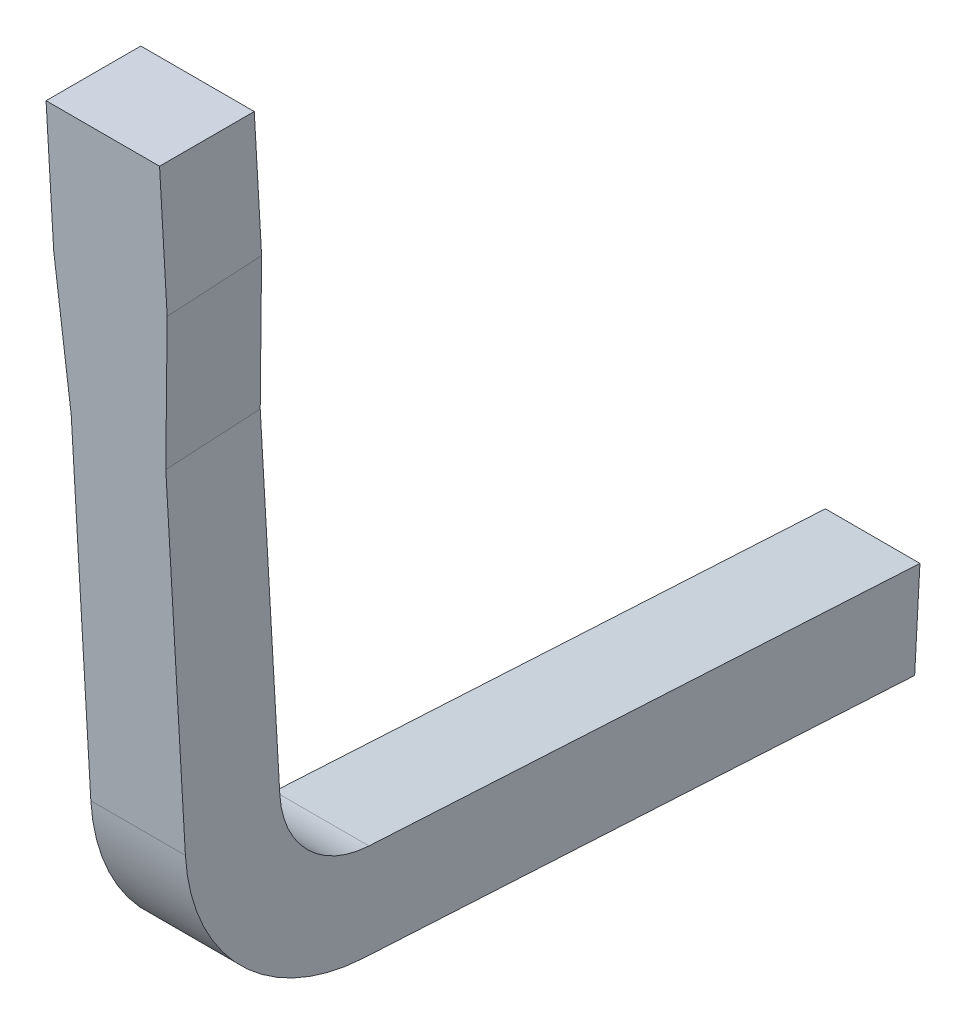
ISO-10303-21;
HEADER;
FILE_DESCRIPTION(('STEP AP214'),'2;1');
FILE_NAME('part.step','',(''),(''),'','','');
FILE_SCHEMA(('AUTOMOTIVE_DESIGN { 1 0 10303 214 1 1 1 1 }'));
ENDSEC;
DATA;
#1=APPLICATION_CONTEXT('core data for automotive mechanical design processes');
#2=APPLICATION_PROTOCOL_DEFINITION('international standard','automotive_design',2000,#1);
#3=PRODUCT_CONTEXT('',#1,'mechanical');
#4=PRODUCT('Part','Part','',(#3));
#5=PRODUCT_RELATED_PRODUCT_CATEGORY('part','',(#4));
#6=PRODUCT_DEFINITION_FORMATION('','',#4);
#7=PRODUCT_DEFINITION_CONTEXT('part definition',#1,'design');
#8=PRODUCT_DEFINITION('design','',#6,#7);
#9=PRODUCT_DEFINITION_SHAPE('','',#8);
#10=(LENGTH_UNIT() NAMED_UNIT(*) SI_UNIT(.MILLI.,.METRE.));
#11=(NAMED_UNIT(*) PLANE_ANGLE_UNIT() SI_UNIT($,.RADIAN.));
#12=(NAMED_UNIT(*) SI_UNIT($,.STERADIAN.) SOLID_ANGLE_UNIT());
#13=UNCERTAINTY_MEASURE_WITH_UNIT(LENGTH_MEASURE(1.E-05),#10,'distance_accuracy_value','');
#14=(GEOMETRIC_REPRESENTATION_CONTEXT(3) GLOBAL_UNCERTAINTY_ASSIGNED_CONTEXT((#13)) GLOBAL_UNIT_ASSIGNED_CONTEXT((#10,
#11,#12)) REPRESENTATION_CONTEXT('',''));
#15=CARTESIAN_POINT('',(0.,0.,0.));
#16=DIRECTION('',(0.,0.,1.));
#17=DIRECTION('',(1.,0.,0.));
#18=AXIS2_PLACEMENT_3D('',#15,#16,#17);
#19=CARTESIAN_POINT('',(-2.12,-1.879082198882,-10.32387202233));
#20=DIRECTION('',(1.,0.,0.));
#21=DIRECTION('',(0.,0.,-1.));
#22=AXIS2_PLACEMENT_3D('',#19,#20,#21);
#23=PLANE('',#22);
#24=DIRECTION('',(1.77809156290928E-13,-0.0569406083160486,0.998377567418559));
#25=VECTOR('',#24,1.);
#26=CARTESIAN_POINT('',(-2.12,-2.014836222708,-10.43177700759));
#27=LINE('',#26,#25);
#28=CARTESIAN_POINT('',(-2.12,-2.01483622270796,-10.4317770075908));
#29=VERTEX_POINT('',#28);
#30=CARTESIAN_POINT('',(-2.11999999999999,-2.02622434437119,-10.2321014941066));
#31=VERTEX_POINT('',#30);
#32=EDGE_CURVE('E183',#29,#31,#27,.T.);
#33=ORIENTED_EDGE('',*,*,#32,.T.);
#34=DIRECTION('',(0.,-0.998377567418999,-0.0569406083083299));
#35=VECTOR('',#34,1.);
#36=CARTESIAN_POINT('',(-2.12,-2.398052209196,-10.25330800505));
#37=LINE('',#36,#35);
#38=CARTESIAN_POINT('',(-2.12,-1.74332817505504,-10.2159670370689));
#39=VERTEX_POINT('',#38);
#40=EDGE_CURVE('E180',#39,#31,#37,.T.);
#41=ORIENTED_EDGE('',*,*,#40,.F.);
#42=DIRECTION('',(0.,0.,1.));
#43=VECTOR('',#42,1.);
#44=CARTESIAN_POINT('',(-2.12,-1.743328175055,-10.31612954398));
#45=LINE('',#44,#43);
#46=CARTESIAN_POINT('',(-2.12,-1.74332817505473,-10.4162920508947));
#47=VERTEX_POINT('',#46);
#48=EDGE_CURVE('E175',#47,#39,#45,.T.);
#49=ORIENTED_EDGE('',*,*,#48,.F.);
#50=DIRECTION('',(0.,-0.998377567418624,-0.0569406083148914));
#51=VECTOR('',#50,1.);
#52=CARTESIAN_POINT('',(-2.12,-2.392358148368,-10.45330826871));
#53=LINE('',#52,#51);
#54=EDGE_CURVE('E205',#47,#29,#53,.T.);
#55=ORIENTED_EDGE('',*,*,#54,.T.);
#56=EDGE_LOOP('',(#33,#41,#49,#55));
#57=FACE_BOUND('',#56,.T.);
#58=ADVANCED_FACE('F17',(#57),#23,.F.);
#59=CARTESIAN_POINT('',(-2.11,-2.170286918652,-10.3404803421));
#60=DIRECTION('',(0.997785157856611,0.0664110879137907,0.00378763292362404));
#61=DIRECTION('',(-0.0664115642910679,0.99779231512796,0.));
#62=AXIS2_PLACEMENT_3D('',#59,#60,#61);
#63=PLANE('',#62);
#64=DIRECTION('',(0.0665190105237393,-0.996166318707665,-0.0568144938493813));
#65=VECTOR('',#64,1.);
#66=CARTESIAN_POINT('',(-2.12,-2.02622434437119,-10.2321014941066));
#67=LINE('',#66,#65);
#68=CARTESIAN_POINT('',(-2.1,-2.32573761459706,-10.2491836765991));
#69=VERTEX_POINT('',#68);
#70=EDGE_CURVE('E161',#31,#69,#67,.T.);
#71=ORIENTED_EDGE('',*,*,#70,.F.);
#72=ORIENTED_EDGE('',*,*,#32,.F.);
#73=DIRECTION('',(0.0665190105237394,-0.996166318707292,-0.0568144938559241));
#74=VECTOR('',#73,1.);
#75=CARTESIAN_POINT('',(-2.12,-2.01483622270793,-10.4317770075911));
#76=LINE('',#75,#74);
#77=CARTESIAN_POINT('',(-2.1,-2.31434949293379,-10.4488591900838));
#78=VERTEX_POINT('',#77);
#79=EDGE_CURVE('E115',#29,#78,#76,.T.);
#80=ORIENTED_EDGE('',*,*,#79,.T.);
#81=DIRECTION('',(0.,-0.0569406083160594,0.998377567418558));
#82=VECTOR('',#81,1.);
#83=CARTESIAN_POINT('',(-2.1,-2.314349492934,-10.44885919008));
#84=LINE('',#83,#82);
#85=EDGE_CURVE('E110',#78,#69,#84,.T.);
#86=ORIENTED_EDGE('',*,*,#85,.T.);
#87=EDGE_LOOP('',(#71,#72,#80,#86));
#88=FACE_BOUND('',#87,.T.);
#89=ADVANCED_FACE('F288',(#88),#63,.F.);
#90=CARTESIAN_POINT('',(-1.88,-1.879082198882,-10.32387202233));
#91=DIRECTION('',(1.,0.,0.));
#92=DIRECTION('',(0.,0.,-1.));
#93=AXIS2_PLACEMENT_3D('',#90,#91,#92);
#94=PLANE('',#93);
#95=DIRECTION('',(0.,-0.998377567418624,-0.0569406083148914));
#96=VECTOR('',#95,1.);
#97=CARTESIAN_POINT('',(-1.88,-2.392358148368,-10.45330826871));
#98=LINE('',#97,#96);
#99=CARTESIAN_POINT('',(-1.87999999999998,-2.01483622270898,-10.4317770075904));
#100=VERTEX_POINT('',#99);
#101=CARTESIAN_POINT('',(-1.88,-1.74332817505473,-10.4162920508947));
#102=VERTEX_POINT('',#101);
#103=EDGE_CURVE('E128',#100,#102,#98,.F.);
#104=ORIENTED_EDGE('',*,*,#103,.T.);
#105=DIRECTION('',(0.,0.,1.));
#106=VECTOR('',#105,1.);
#107=CARTESIAN_POINT('',(-1.88,-1.743328175055,-10.31612954398));
#108=LINE('',#107,#106);
#109=CARTESIAN_POINT('',(-1.88,-1.74332817505504,-10.2159670370692));
#110=VERTEX_POINT('',#109);
#111=EDGE_CURVE('E185',#110,#102,#108,.F.);
#112=ORIENTED_EDGE('',*,*,#111,.F.);
#113=DIRECTION('',(0.,-0.998377567418999,-0.0569406083083299));
#114=VECTOR('',#113,1.);
#115=CARTESIAN_POINT('',(-1.88,-2.398052209196,-10.25330800505));
#116=LINE('',#115,#114);
#117=CARTESIAN_POINT('',(-1.87999999999999,-2.02622434437119,-10.2321014941066));
#118=VERTEX_POINT('',#117);
#119=EDGE_CURVE('E168',#118,#110,#116,.F.);
#120=ORIENTED_EDGE('',*,*,#119,.F.);
#121=DIRECTION('',(0.,-0.0569406083110731,0.998377567418842));
#122=VECTOR('',#121,1.);
#123=CARTESIAN_POINT('',(-1.87999999999997,-2.014836222709,-10.43177700759));
#124=LINE('',#123,#122);
#125=EDGE_CURVE('E131',#100,#118,#124,.T.);
#126=ORIENTED_EDGE('',*,*,#125,.F.);
#127=EDGE_LOOP('',(#104,#112,#120,#126));
#128=FACE_BOUND('',#127,.T.);
#129=ADVANCED_FACE('F251',(#128),#94,.T.);
#130=CARTESIAN_POINT('',(-2.,-1.743328175055,-10.31612954398));
#131=DIRECTION('',(0.,1.,0.));
#132=DIRECTION('',(0.,0.,1.));
#133=AXIS2_PLACEMENT_3D('',#130,#131,#132);
#134=PLANE('',#133);
#135=DIRECTION('',(1.,0.,0.));
#136=VECTOR('',#135,1.);
#137=CARTESIAN_POINT('',(-2.,-1.74332817505459,-10.4162920508971));
#138=LINE('',#137,#136);
#139=EDGE_CURVE('E138',#102,#47,#138,.F.);
#140=ORIENTED_EDGE('',*,*,#139,.T.);
#141=ORIENTED_EDGE('',*,*,#48,.T.);
#142=DIRECTION('',(1.,0.,0.));
#143=VECTOR('',#142,1.);
#144=CARTESIAN_POINT('',(-2.,-1.74332817505506,-10.2159670370689));
#145=LINE('',#144,#143);
#146=EDGE_CURVE('E171',#110,#39,#145,.F.);
#147=ORIENTED_EDGE('',*,*,#146,.F.);
#148=ORIENTED_EDGE('',*,*,#111,.T.);
#149=EDGE_LOOP('',(#140,#141,#147,#148));
#150=FACE_BOUND('',#149,.T.);
#151=ADVANCED_FACE('F291',(#150),#134,.T.);
#152=CARTESIAN_POINT('',(-2.1,-2.898875732105,-11.04167004462));
#153=DIRECTION('',(1.,0.,0.));
#154=DIRECTION('',(0.,0.,-1.));
#155=AXIS2_PLACEMENT_3D('',#152,#153,#154);
#156=PLANE('',#155);
#157=CARTESIAN_POINT('',(-2.1,-3.03,-10.69));
#158=DIRECTION('',(-1.,0.,0.));
#159=DIRECTION('',(0.,0.,1.));
#160=AXIS2_PLACEMENT_3D('',#157,#158,#159);
#161=CIRCLE('',#160,0.4);
#162=CARTESIAN_POINT('',(-2.1,-3.05277624332116,-10.2906489730313));
#163=VERTEX_POINT('',#162);
#164=CARTESIAN_POINT('',(-2.1,-3.42937693582933,-10.6676826720305));
#165=VERTEX_POINT('',#164);
#166=EDGE_CURVE('E155',#163,#165,#161,.F.);
#167=ORIENTED_EDGE('',*,*,#166,.F.);
#168=DIRECTION('',(0.,-0.998377567418999,-0.0569406083083299));
#169=VECTOR('',#168,1.);
#170=CARTESIAN_POINT('',(-2.1,-2.398052209196,-10.25330800505));
#171=LINE('',#170,#169);
#172=EDGE_CURVE('E158',#69,#163,#171,.T.);
#173=ORIENTED_EDGE('',*,*,#172,.F.);
#174=ORIENTED_EDGE('',*,*,#85,.F.);
#175=DIRECTION('',(0.,-0.998377567418624,-0.0569406083148914));
#176=VECTOR('',#175,1.);
#177=CARTESIAN_POINT('',(-2.1,-2.392358148368,-10.45330826871));
#178=LINE('',#177,#176);
#179=CARTESIAN_POINT('',(-2.1,-3.0413881216286,-10.4903244865199));
#180=VERTEX_POINT('',#179);
#181=EDGE_CURVE('E104',#78,#180,#178,.T.);
#182=ORIENTED_EDGE('',*,*,#181,.T.);
#183=CARTESIAN_POINT('',(-2.1,-3.03,-10.69));
#184=DIRECTION('',(-1.,0.,0.));
#185=DIRECTION('',(0.,0.,1.));
#186=AXIS2_PLACEMENT_3D('',#183,#184,#185);
#187=CIRCLE('',#186,0.2);
#188=CARTESIAN_POINT('',(-2.1,-3.22968846791482,-10.6788413360177));
#189=VERTEX_POINT('',#188);
#190=EDGE_CURVE('E20',#180,#189,#187,.F.);
#191=ORIENTED_EDGE('',*,*,#190,.T.);
#192=DIRECTION('',(0.,0.0557933199228295,0.998442339572991));
#193=VECTOR('',#192,1.);
#194=CARTESIAN_POINT('',(-2.1,-3.262244863925,-11.26145022621));
#195=LINE('',#194,#193);
#196=CARTESIAN_POINT('',(-2.1,-3.29480125993501,-11.8440591164004));
#197=VERTEX_POINT('',#196);
#198=EDGE_CURVE('E123',#197,#189,#195,.T.);
#199=ORIENTED_EDGE('',*,*,#198,.F.);
#200=DIRECTION('',(0.,-0.998442339574031,0.0557933199042218));
#201=VECTOR('',#200,1.);
#202=CARTESIAN_POINT('',(-2.1,-3.394645493892,-11.83847978441));
#203=LINE('',#202,#201);
#204=CARTESIAN_POINT('',(-2.1,-3.49448972784906,-11.8329004524196));
#205=VERTEX_POINT('',#204);
#206=EDGE_CURVE('E148',#197,#205,#203,.T.);
#207=ORIENTED_EDGE('',*,*,#206,.T.);
#208=DIRECTION('',(0.,0.055793319922371,0.998442339573017));
#209=VECTOR('',#208,1.);
#210=CARTESIAN_POINT('',(-2.1,-3.461933331839,-11.25029156222));
#211=LINE('',#210,#209);
#212=EDGE_CURVE('E153',#205,#165,#211,.T.);
#213=ORIENTED_EDGE('',*,*,#212,.T.);
#214=EDGE_LOOP('',(#167,#173,#174,#182,#191,#199,#207,#213));
#215=FACE_BOUND('',#214,.T.);
#216=ADVANCED_FACE('F107',(#215),#156,.F.);
#217=CARTESIAN_POINT('',(-2.,-3.262244863925,-11.26145022621));
#218=DIRECTION('',(0.,0.998442339572991,-0.0557933199228295));
#219=DIRECTION('',(0.,0.0557933199228295,0.998442339572991));
#220=AXIS2_PLACEMENT_3D('',#217,#218,#219);
#221=PLANE('',#220);
#222=DIRECTION('',(0.,0.055793319922887,0.998442339572988));
#223=VECTOR('',#222,1.);
#224=CARTESIAN_POINT('',(-1.9,-3.294801259935,-11.8440591164));
#225=LINE('',#224,#223);
#226=CARTESIAN_POINT('',(-1.9,-3.29480125993501,-11.8440591164001));
#227=VERTEX_POINT('',#226);
#228=CARTESIAN_POINT('',(-1.9,-3.2296884679148,-10.6788413360177));
#229=VERTEX_POINT('',#228);
#230=EDGE_CURVE('E142',#227,#229,#225,.T.);
#231=ORIENTED_EDGE('',*,*,#230,.F.);
#232=DIRECTION('',(1.,0.,0.));
#233=VECTOR('',#232,1.);
#234=CARTESIAN_POINT('',(-2.,-3.29480125993502,-11.8440591164004));
#235=LINE('',#234,#233);
#236=EDGE_CURVE('E139',#227,#197,#235,.F.);
#237=ORIENTED_EDGE('',*,*,#236,.T.);
#238=ORIENTED_EDGE('',*,*,#198,.T.);
#239=DIRECTION('',(-1.,0.,0.));
#240=VECTOR('',#239,1.);
#241=CARTESIAN_POINT('',(-1.896,-3.22968846791485,-10.67884133602));
#242=LINE('',#241,#240);
#243=EDGE_CURVE('E122',#189,#229,#242,.F.);
#244=ORIENTED_EDGE('',*,*,#243,.T.);
#245=EDGE_LOOP('',(#231,#237,#238,#244));
#246=FACE_BOUND('',#245,.T.);
#247=ADVANCED_FACE('F284',(#246),#221,.T.);
#248=CARTESIAN_POINT('',(-1.896,-3.03,-10.69));
#249=DIRECTION('',(-1.,0.,0.));
#250=DIRECTION('',(0.,0.,1.));
#251=AXIS2_PLACEMENT_3D('',#248,#249,#250);
#252=CYLINDRICAL_SURFACE('',#251,0.2);
#253=ORIENTED_EDGE('',*,*,#190,.F.);
#254=DIRECTION('',(1.,0.,0.));
#255=VECTOR('',#254,1.);
#256=CARTESIAN_POINT('',(-2.,-3.04138812159455,-10.4903244865179));
#257=LINE('',#256,#255);
#258=CARTESIAN_POINT('',(-1.9,-3.04138812162905,-10.4903244865184));
#259=VERTEX_POINT('',#258);
#260=EDGE_CURVE('E114',#180,#259,#257,.T.);
#261=ORIENTED_EDGE('',*,*,#260,.T.);
#262=CARTESIAN_POINT('',(-1.9,-3.03,-10.69));
#263=DIRECTION('',(-1.,0.,0.));
#264=DIRECTION('',(0.,0.,1.));
#265=AXIS2_PLACEMENT_3D('',#262,#263,#264);
#266=CIRCLE('',#265,0.2);
#267=EDGE_CURVE('E223',#229,#259,#266,.T.);
#268=ORIENTED_EDGE('',*,*,#267,.F.);
#269=ORIENTED_EDGE('',*,*,#243,.F.);
#270=EDGE_LOOP('',(#253,#261,#268,#269));
#271=FACE_BOUND('',#270,.T.);
#272=ADVANCED_FACE('F119',(#271),#252,.F.);
#273=CARTESIAN_POINT('',(-2.,-2.392358148368,-10.45330826871));
#274=DIRECTION('',(0.,-0.0569406083148914,0.998377567418624));
#275=DIRECTION('',(0.,-0.998377567418624,-0.0569406083148914));
#276=AXIS2_PLACEMENT_3D('',#273,#274,#275);
#277=PLANE('',#276);
#278=DIRECTION('',(0.0665190105240586,0.996166318708109,0.0568144938412267));
#279=VECTOR('',#278,1.);
#280=CARTESIAN_POINT('',(-1.9,-2.314349492934,-10.44885919008));
#281=LINE('',#280,#279);
#282=CARTESIAN_POINT('',(-1.9,-2.314349492934,-10.44885919008));
#283=VERTEX_POINT('',#282);
#284=EDGE_CURVE('E165',#283,#100,#281,.T.);
#285=ORIENTED_EDGE('',*,*,#284,.F.);
#286=DIRECTION('',(0.,0.998377567418421,0.0569406083184697));
#287=VECTOR('',#286,1.);
#288=CARTESIAN_POINT('',(-1.9,-3.041388121684,-10.49032448652));
#289=LINE('',#288,#287);
#290=EDGE_CURVE('E126',#259,#283,#289,.T.);
#291=ORIENTED_EDGE('',*,*,#290,.F.);
#292=ORIENTED_EDGE('',*,*,#260,.F.);
#293=ORIENTED_EDGE('',*,*,#181,.F.);
#294=ORIENTED_EDGE('',*,*,#79,.F.);
#295=ORIENTED_EDGE('',*,*,#54,.F.);
#296=ORIENTED_EDGE('',*,*,#139,.F.);
#297=ORIENTED_EDGE('',*,*,#103,.F.);
#298=EDGE_LOOP('',(#285,#291,#292,#293,#294,#295,#296,#297));
#299=FACE_BOUND('',#298,.T.);
#300=ADVANCED_FACE('F124',(#299),#277,.F.);
#301=CARTESIAN_POINT('',(-1.89,-2.170286918653,-10.34048034209));
#302=DIRECTION('',(0.99778515785659,-0.0664110879141193,-0.00378763292348296));
#303=DIRECTION('',(0.0664115642913965,0.997792315127938,0.));
#304=AXIS2_PLACEMENT_3D('',#301,#302,#303);
#305=PLANE('',#304);
#306=DIRECTION('',(0.,-0.0569406083160594,0.998377567418558));
#307=VECTOR('',#306,1.);
#308=CARTESIAN_POINT('',(-1.9,-2.314349492934,-10.44885919008));
#309=LINE('',#308,#307);
#310=CARTESIAN_POINT('',(-1.9,-2.32573761459702,-10.2491836765997));
#311=VERTEX_POINT('',#310);
#312=EDGE_CURVE('E238',#283,#311,#309,.T.);
#313=ORIENTED_EDGE('',*,*,#312,.F.);
#314=ORIENTED_EDGE('',*,*,#284,.T.);
#315=ORIENTED_EDGE('',*,*,#125,.T.);
#316=DIRECTION('',(0.0665190105237393,0.996166318707665,0.0568144938493813));
#317=VECTOR('',#316,1.);
#318=CARTESIAN_POINT('',(-1.9,-2.32573761459705,-10.2491836765991));
#319=LINE('',#318,#317);
#320=EDGE_CURVE('E160',#311,#118,#319,.T.);
#321=ORIENTED_EDGE('',*,*,#320,.F.);
#322=EDGE_LOOP('',(#313,#314,#315,#321));
#323=FACE_BOUND('',#322,.T.);
#324=ADVANCED_FACE('F245',(#323),#305,.T.);
#325=CARTESIAN_POINT('',(-2.,-2.398052209196,-10.25330800505));
#326=DIRECTION('',(0.,-0.0569406083083299,0.998377567418999));
#327=DIRECTION('',(0.,-0.998377567418999,-0.0569406083083299));
#328=AXIS2_PLACEMENT_3D('',#325,#326,#327);
#329=PLANE('',#328);
#330=ORIENTED_EDGE('',*,*,#119,.T.);
#331=ORIENTED_EDGE('',*,*,#146,.T.);
#332=ORIENTED_EDGE('',*,*,#40,.T.);
#333=ORIENTED_EDGE('',*,*,#70,.T.);
#334=ORIENTED_EDGE('',*,*,#172,.T.);
#335=DIRECTION('',(-1.,0.,0.));
#336=VECTOR('',#335,1.);
#337=CARTESIAN_POINT('',(-1.896,-3.05277624331888,-10.2906489730321));
#338=LINE('',#337,#336);
#339=CARTESIAN_POINT('',(-1.9,-3.05277624332089,-10.2906489730312));
#340=VERTEX_POINT('',#339);
#341=EDGE_CURVE('E198',#340,#163,#338,.T.);
#342=ORIENTED_EDGE('',*,*,#341,.F.);
#343=DIRECTION('',(0.,-0.998377567419076,-0.0569406083069694));
#344=VECTOR('',#343,1.);
#345=CARTESIAN_POINT('',(-1.9,-2.325737614597,-10.2491836766));
#346=LINE('',#345,#344);
#347=EDGE_CURVE('E222',#311,#340,#346,.T.);
#348=ORIENTED_EDGE('',*,*,#347,.F.);
#349=ORIENTED_EDGE('',*,*,#320,.T.);
#350=EDGE_LOOP('',(#330,#331,#332,#333,#334,#342,#348,#349));
#351=FACE_BOUND('',#350,.T.);
#352=ADVANCED_FACE('F255',(#351),#329,.T.);
#353=CARTESIAN_POINT('',(-1.896,-3.03,-10.69));
#354=DIRECTION('',(-1.,0.,0.));
#355=DIRECTION('',(0.,0.,1.));
#356=AXIS2_PLACEMENT_3D('',#353,#354,#355);
#357=CYLINDRICAL_SURFACE('',#356,0.4);
#358=DIRECTION('',(1.,0.,0.));
#359=VECTOR('',#358,1.);
#360=CARTESIAN_POINT('',(-2.,-3.4293769358293,-10.66768267203));
#361=LINE('',#360,#359);
#362=CARTESIAN_POINT('',(-1.9,-3.42937693582946,-10.6676826720306));
#363=VERTEX_POINT('',#362);
#364=EDGE_CURVE('E150',#165,#363,#361,.T.);
#365=ORIENTED_EDGE('',*,*,#364,.T.);
#366=CARTESIAN_POINT('',(-1.9,-3.03,-10.69));
#367=DIRECTION('',(-1.,0.,0.));
#368=DIRECTION('',(0.,0.,1.));
#369=AXIS2_PLACEMENT_3D('',#366,#367,#368);
#370=CIRCLE('',#369,0.4);
#371=EDGE_CURVE('E219',#340,#363,#370,.F.);
#372=ORIENTED_EDGE('',*,*,#371,.F.);
#373=ORIENTED_EDGE('',*,*,#341,.T.);
#374=ORIENTED_EDGE('',*,*,#166,.T.);
#375=EDGE_LOOP('',(#365,#372,#373,#374));
#376=FACE_BOUND('',#375,.T.);
#377=ADVANCED_FACE('F273',(#376),#357,.T.);
#378=CARTESIAN_POINT('',(-2.,-3.461933331839,-11.25029156222));
#379=DIRECTION('',(0.,0.998442339573017,-0.055793319922371));
#380=DIRECTION('',(0.,0.055793319922371,0.998442339573017));
#381=AXIS2_PLACEMENT_3D('',#378,#379,#380);
#382=PLANE('',#381);
#383=ORIENTED_EDGE('',*,*,#364,.F.);
#384=ORIENTED_EDGE('',*,*,#212,.F.);
#385=DIRECTION('',(1.,0.,0.));
#386=VECTOR('',#385,1.);
#387=CARTESIAN_POINT('',(-2.,-3.49448972784898,-11.8329004524196));
#388=LINE('',#387,#386);
#389=CARTESIAN_POINT('',(-1.9,-3.49448972784899,-11.8329004524199));
#390=VERTEX_POINT('',#389);
#391=EDGE_CURVE('E35',#205,#390,#388,.T.);
#392=ORIENTED_EDGE('',*,*,#391,.T.);
#393=DIRECTION('',(0.,-0.0557933199219327,-0.998442339573042));
#394=VECTOR('',#393,1.);
#395=CARTESIAN_POINT('',(-1.9,-3.429376935829,-10.66768267202));
#396=LINE('',#395,#394);
#397=EDGE_CURVE('E26',#363,#390,#396,.T.);
#398=ORIENTED_EDGE('',*,*,#397,.F.);
#399=EDGE_LOOP('',(#383,#384,#392,#398));
#400=FACE_BOUND('',#399,.T.);
#401=ADVANCED_FACE('F274',(#400),#382,.F.);
#402=CARTESIAN_POINT('',(-2.,-3.394645493892,-11.83847978441));
#403=DIRECTION('',(0.,0.0557933199042218,0.998442339574031));
#404=DIRECTION('',(0.,-0.998442339574031,0.0557933199042218));
#405=AXIS2_PLACEMENT_3D('',#402,#403,#404);
#406=PLANE('',#405);
#407=DIRECTION('',(0.,0.998442339574254,-0.0557933199002383));
#408=VECTOR('',#407,1.);
#409=CARTESIAN_POINT('',(-1.9,-3.494489727849,-11.83290045242));
#410=LINE('',#409,#408);
#411=EDGE_CURVE('E11',#390,#227,#410,.T.);
#412=ORIENTED_EDGE('',*,*,#411,.F.);
#413=ORIENTED_EDGE('',*,*,#391,.F.);
#414=ORIENTED_EDGE('',*,*,#206,.F.);
#415=ORIENTED_EDGE('',*,*,#236,.F.);
#416=EDGE_LOOP('',(#412,#413,#414,#415));
#417=FACE_BOUND('',#416,.T.);
#418=ADVANCED_FACE('F281',(#417),#406,.F.);
#419=CARTESIAN_POINT('',(-1.9,-2.909472777839,-11.05227927458));
#420=DIRECTION('',(1.,0.,0.));
#421=DIRECTION('',(0.,0.,-1.));
#422=AXIS2_PLACEMENT_3D('',#419,#420,#421);
#423=PLANE('',#422);
#424=ORIENTED_EDGE('',*,*,#397,.T.);
#425=ORIENTED_EDGE('',*,*,#411,.T.);
#426=ORIENTED_EDGE('',*,*,#230,.T.);
#427=ORIENTED_EDGE('',*,*,#267,.T.);
#428=ORIENTED_EDGE('',*,*,#290,.T.);
#429=ORIENTED_EDGE('',*,*,#312,.T.);
#430=ORIENTED_EDGE('',*,*,#347,.T.);
#431=ORIENTED_EDGE('',*,*,#371,.T.);
#432=EDGE_LOOP('',(#424,#425,#426,#427,#428,#429,#430,#431));
#433=FACE_BOUND('',#432,.T.);
#434=ADVANCED_FACE('F260',(#433),#423,.T.);
#435=CLOSED_SHELL('',(#58,#89,#129,#151,#216,#247,#272,#300,#324,#352,#377,#401,#418,#434));
#436=MANIFOLD_SOLID_BREP('B1',#435);
#437=ADVANCED_BREP_SHAPE_REPRESENTATION('',(#18,#436),#14);
#438=SHAPE_DEFINITION_REPRESENTATION(#9,#437);
ENDSEC;
END-ISO-10303-21;
